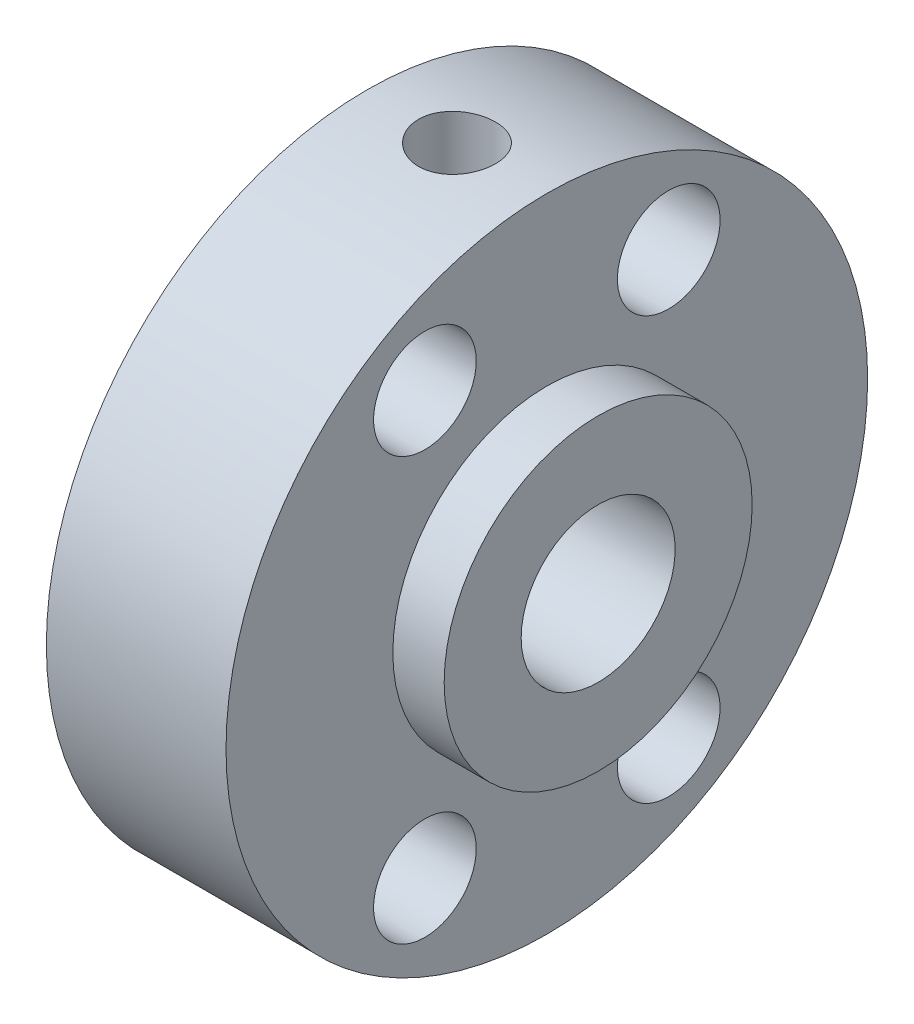
ISO-10303-21;
HEADER;
FILE_DESCRIPTION(('STEP AP214'),'2;1');
FILE_NAME('part.step','',(''),(''),'','','');
FILE_SCHEMA(('AUTOMOTIVE_DESIGN { 1 0 10303 214 1 1 1 1 }'));
ENDSEC;
DATA;
#1=APPLICATION_CONTEXT('core data for automotive mechanical design processes');
#2=APPLICATION_PROTOCOL_DEFINITION('international standard','automotive_design',2000,#1);
#3=PRODUCT_CONTEXT('',#1,'mechanical');
#4=PRODUCT('Part','Part','',(#3));
#5=PRODUCT_RELATED_PRODUCT_CATEGORY('part','',(#4));
#6=PRODUCT_DEFINITION_FORMATION('','',#4);
#7=PRODUCT_DEFINITION_CONTEXT('part definition',#1,'design');
#8=PRODUCT_DEFINITION('design','',#6,#7);
#9=PRODUCT_DEFINITION_SHAPE('','',#8);
#10=(LENGTH_UNIT() NAMED_UNIT(*) SI_UNIT(.MILLI.,.METRE.));
#11=(NAMED_UNIT(*) PLANE_ANGLE_UNIT() SI_UNIT($,.RADIAN.));
#12=(NAMED_UNIT(*) SI_UNIT($,.STERADIAN.) SOLID_ANGLE_UNIT());
#13=UNCERTAINTY_MEASURE_WITH_UNIT(LENGTH_MEASURE(1.E-05),#10,'distance_accuracy_value','');
#14=(GEOMETRIC_REPRESENTATION_CONTEXT(3) GLOBAL_UNCERTAINTY_ASSIGNED_CONTEXT((#13)) GLOBAL_UNIT_ASSIGNED_CONTEXT((#10,
#11,#12)) REPRESENTATION_CONTEXT('',''));
#15=CARTESIAN_POINT('',(0.,0.,0.));
#16=DIRECTION('',(0.,0.,1.));
#17=DIRECTION('',(1.,0.,0.));
#18=AXIS2_PLACEMENT_3D('',#15,#16,#17);
#19=CARTESIAN_POINT('',(0.,0.,0.));
#20=DIRECTION('',(-1.,0.,0.));
#21=DIRECTION('',(0.,0.,1.));
#22=AXIS2_PLACEMENT_3D('',#19,#20,#21);
#23=CYLINDRICAL_SURFACE('',#22,3.);
#24=CARTESIAN_POINT('',(9.,0.,0.));
#25=DIRECTION('',(-1.,0.,0.));
#26=DIRECTION('',(0.,0.,1.));
#27=AXIS2_PLACEMENT_3D('',#24,#25,#26);
#28=CIRCLE('',#27,3.);
#29=CARTESIAN_POINT('',(9.,0.,3.));
#30=VERTEX_POINT('',#29);
#31=EDGE_CURVE('E63',#30,#30,#28,.T.);
#32=ORIENTED_EDGE('',*,*,#31,.F.);
#33=EDGE_LOOP('',(#32));
#34=FACE_BOUND('',#33,.T.);
#35=CARTESIAN_POINT('',(0.,0.,0.));
#36=DIRECTION('',(-1.,0.,0.));
#37=DIRECTION('',(0.,0.,1.));
#38=AXIS2_PLACEMENT_3D('',#35,#36,#37);
#39=CIRCLE('',#38,3.);
#40=CARTESIAN_POINT('',(0.,0.,3.));
#41=VERTEX_POINT('',#40);
#42=EDGE_CURVE('E10',#41,#41,#39,.T.);
#43=ORIENTED_EDGE('',*,*,#42,.T.);
#44=EDGE_LOOP('',(#43));
#45=FACE_BOUND('',#44,.T.);
#46=CARTESIAN_POINT('',(3.5,2.59807621135332,-1.5));
#47=CARTESIAN_POINT('',(3.57816171229288,2.59808302092689,-1.4999945446118));
#48=CARTESIAN_POINT('',(3.65642211728757,2.60165701781635,-1.49384995609982));
#49=CARTESIAN_POINT('',(3.81054089701573,2.61543549678079,-1.46958481484708));
#50=CARTESIAN_POINT('',(3.88639387256511,2.62565391083339,-1.45143909683127));
#51=CARTESIAN_POINT('',(4.03317749651591,2.65124019908098,-1.40414992304972));
#52=CARTESIAN_POINT('',(4.10413197871038,2.66658065209878,-1.3750649287406));
#53=CARTESIAN_POINT('',(4.24013630299508,2.70063997225287,-1.30690128806456));
#54=CARTESIAN_POINT('',(4.30518582539369,2.71935902214097,-1.26782210105366));
#55=CARTESIAN_POINT('',(4.43345859283626,2.75995303586162,-1.17699981079632));
#56=CARTESIAN_POINT('',(4.49608870351032,2.7819609545693,-1.12447805421565));
#57=CARTESIAN_POINT('',(4.61211258261006,2.82557974178559,-1.0098807114217));
#58=CARTESIAN_POINT('',(4.66550174387528,2.84719040746875,-0.947800388673439));
#59=CARTESIAN_POINT('',(4.76505072672149,2.88932215429424,-0.810734345121818));
#60=CARTESIAN_POINT('',(4.81048065178929,2.90967159627259,-0.735160783518861));
#61=CARTESIAN_POINT('',(4.88771127986864,2.94526134149293,-0.576235539899255));
#62=CARTESIAN_POINT('',(4.91952058420575,2.96050486775612,-0.492888807207232));
#63=CARTESIAN_POINT('',(4.96625699195164,2.98320691866356,-0.327067415888966));
#64=CARTESIAN_POINT('',(4.9822242895333,2.99114220331338,-0.244952685733226));
#65=CARTESIAN_POINT('',(5.00024917801256,3.000113757691,-0.0788559430467724));
#66=CARTESIAN_POINT('',(5.00231518519356,3.00115420176885,0.00512490876560744));
#67=CARTESIAN_POINT('',(4.99287998904448,2.99644472874675,0.164748786635625));
#68=CARTESIAN_POINT('',(4.98254297671817,2.99127743838241,0.240481798765187));
#69=CARTESIAN_POINT('',(4.95067873414301,2.97561367889621,0.388970657877483));
#70=CARTESIAN_POINT('',(4.92915066653566,2.96511681099591,0.461726281640888));
#71=CARTESIAN_POINT('',(4.87537615086528,2.93957374931482,0.60346408735433));
#72=CARTESIAN_POINT('',(4.8429855302419,2.92446662293799,0.672380135272767));
#73=CARTESIAN_POINT('',(4.76860487569776,2.89106468980031,0.803965202269992));
#74=CARTESIAN_POINT('',(4.72661140504647,2.87276874236226,0.866631973257968));
#75=CARTESIAN_POINT('',(4.62965697270048,2.83266591598844,0.990260491347292));
#76=CARTESIAN_POINT('',(4.57384545751099,2.81069063997263,1.05050111254404));
#77=CARTESIAN_POINT('',(4.45311541260473,2.76681510880218,1.16115655544667));
#78=CARTESIAN_POINT('',(4.38818994158891,2.74491492398443,1.21156381736135));
#79=CARTESIAN_POINT('',(4.24602771136387,2.70216234138727,1.30425800196332));
#80=CARTESIAN_POINT('',(4.16827096541868,2.68146479986061,1.34582597246708));
#81=CARTESIAN_POINT('',(4.0055934929615,2.64563175417864,1.41497866950185));
#82=CARTESIAN_POINT('',(3.92068035047366,2.63049045069101,1.44257798731633));
#83=CARTESIAN_POINT('',(3.75317823307581,2.60916953725552,1.48077031653756));
#84=CARTESIAN_POINT('',(3.67093832143467,2.60237483772745,1.49253768317996));
#85=CARTESIAN_POINT('',(3.50539798772519,2.59676879042414,1.50227541991714));
#86=CARTESIAN_POINT('',(3.42209835632032,2.59795180333967,1.50025553597254));
#87=CARTESIAN_POINT('',(3.26651912213191,2.60751504810877,1.48355406501595));
#88=CARTESIAN_POINT('',(3.19403082333811,2.61509381259981,1.4702817250687));
#89=CARTESIAN_POINT('',(3.05244832059356,2.63541032327012,1.43354442694866));
#90=CARTESIAN_POINT('',(2.98335522388009,2.64814974007551,1.41007616793542));
#91=CARTESIAN_POINT('',(2.84688300364596,2.67804333119485,1.35247138290733));
#92=CARTESIAN_POINT('',(2.77973147471967,2.69537464864595,1.31789109553908));
#93=CARTESIAN_POINT('',(2.65179609269151,2.73234179245875,1.23943059602371));
#94=CARTESIAN_POINT('',(2.59101553473008,2.75197880032721,1.19554560649832));
#95=CARTESIAN_POINT('',(2.46953184871468,2.79431997684504,1.09325575079828));
#96=CARTESIAN_POINT('',(2.40980427392351,2.81709874731434,1.03371790847245));
#97=CARTESIAN_POINT('',(2.30088164300961,2.86101352466839,0.905106743097433));
#98=CARTESIAN_POINT('',(2.25169014465419,2.88214897511564,0.83603021198302));
#99=CARTESIAN_POINT('',(2.16413941107485,2.92112042536435,0.687803043838135));
#100=CARTESIAN_POINT('',(2.12610032268364,2.93885462508044,0.608434646361169));
#101=CARTESIAN_POINT('',(2.06429314421391,2.96825032438951,0.443283546961623));
#102=CARTESIAN_POINT('',(2.04051252295054,2.97991715514559,0.357506552088264));
#103=CARTESIAN_POINT('',(2.00994715373801,2.99501262272824,0.190469523495626));
#104=CARTESIAN_POINT('',(2.00180318618583,2.99909891862287,0.109517165775686));
#105=CARTESIAN_POINT('',(1.9987351018184,3.00063195562697,-0.0526889789268051));
#106=CARTESIAN_POINT('',(2.00380635721466,2.99808102100335,-0.13394265044263));
#107=CARTESIAN_POINT('',(2.02612461019344,2.98700953256884,-0.28880698847572));
#108=CARTESIAN_POINT('',(2.04254727388651,2.97889342001985,-0.362568476716895));
#109=CARTESIAN_POINT('',(2.08599049895446,2.95788140495135,-0.506168928275426));
#110=CARTESIAN_POINT('',(2.11301258014018,2.94498481699194,-0.576007327433263));
#111=CARTESIAN_POINT('',(2.17809057824896,2.9148889612218,-0.713135109367326));
#112=CARTESIAN_POINT('',(2.21656898481176,2.89752925798199,-0.780187714050069));
#113=CARTESIAN_POINT('',(2.30293689628858,2.86032199712739,-0.907161962721036));
#114=CARTESIAN_POINT('',(2.35083072367351,2.84047329837541,-0.96708031112236));
#115=CARTESIAN_POINT('',(2.46019570853405,2.79792915339941,-1.08437100623534));
#116=CARTESIAN_POINT('',(2.52254373121579,2.77514698517547,-1.14089652680891));
#117=CARTESIAN_POINT('',(2.65617608169466,2.73094614244278,-1.24299493109201));
#118=CARTESIAN_POINT('',(2.72746823130153,2.70952868642798,-1.28855812501509));
#119=CARTESIAN_POINT('',(2.87995496987143,2.66999407957374,-1.36864661967848));
#120=CARTESIAN_POINT('',(2.9613912966931,2.65200261384405,-1.40277759894141));
#121=CARTESIAN_POINT('',(3.12999860650967,2.62299234492527,-1.45631806425962));
#122=CARTESIAN_POINT('',(3.21714933336903,2.61195024221553,-1.47577678676302));
#123=CARTESIAN_POINT('',(3.33770803347799,2.60293908902686,-1.49155051179662));
#124=CARTESIAN_POINT('',(3.37005184159682,2.60112193507728,-1.49471415744578));
#125=CARTESIAN_POINT('',(3.43492472102337,2.59868903831625,-1.49894010763494));
#126=CARTESIAN_POINT('',(3.46745380457881,2.59807337587664,-1.50000227159981));
#127=CARTESIAN_POINT('',(3.5,2.59807621135332,-1.5));
#128=B_SPLINE_CURVE_WITH_KNOTS('',3,(#46,#47,#48,#49,#50,#51,#52,#53,#54,#55,#56,#57,#58,#59,
#60,#61,#62,#63,#64,#65,#66,#67,#68,#69,#70,#71,#72,#73,#74,#75,#76,#77,#78,#79,#80,#81,#82,#83,
#84,#85,#86,#87,#88,#89,#90,#91,#92,#93,#94,#95,#96,#97,#98,#99,#100,#101,#102,#103,#104,#105,
#106,#107,#108,#109,#110,#111,#112,#113,#114,#115,#116,#117,#118,#119,#120,#121,#122,#123,#124,
#125,#126,#127),.UNSPECIFIED.,.T.,.F.,(4,2,2,2,2,2,2,2,2,2,2,2,2,2,2,2,2,2,2,2,2,2,2,2,2,2,2,2,
2,2,2,2,2,2,2,2,2,2,2,2,4),(0.,0.234348183892073,0.469189339237207,0.702792893878327,
0.936409088167724,1.18929346874735,1.44230356626556,1.71236838358145,1.98226240445836,
2.23295227451903,2.4834903552906,2.71224146226807,2.94100968776182,3.1729430209672,
3.40495949025407,3.65890787185336,3.91305072368878,4.18333262594172,4.45333161317557,
4.70193436281317,4.95036139782559,5.17161275136038,5.39293578654094,5.62450944609131,
5.85620229330071,6.11710115370919,6.37808797467303,6.64596272119448,6.91360169713157,
7.1566840558423,7.39968130190957,7.62666637307238,7.85368400268019,8.09041126079207,
8.32724745151078,8.587653627751,8.84828914267731,9.11716123557907,9.38512699504139,
9.48270202777963,9.5802835874181),.UNSPECIFIED.);
#129=CARTESIAN_POINT('',(3.5,2.59807621135332,-1.5));
#130=VERTEX_POINT('',#129);
#131=EDGE_CURVE('E88',#130,#130,#128,.T.);
#132=ORIENTED_EDGE('',*,*,#131,.F.);
#133=EDGE_LOOP('',(#132));
#134=FACE_BOUND('',#133,.T.);
#135=ADVANCED_FACE('F35',(#34,#45,#134),#23,.F.);
#136=CARTESIAN_POINT('',(0.,0.,0.));
#137=DIRECTION('',(-1.,0.,0.));
#138=DIRECTION('',(0.,0.,1.));
#139=AXIS2_PLACEMENT_3D('',#136,#137,#138);
#140=CYLINDRICAL_SURFACE('',#139,12.5);
#141=CARTESIAN_POINT('',(0.,0.,0.));
#142=DIRECTION('',(-1.,0.,0.));
#143=DIRECTION('',(0.,0.,1.));
#144=AXIS2_PLACEMENT_3D('',#141,#142,#143);
#145=CIRCLE('',#144,12.5);
#146=CARTESIAN_POINT('',(0.,0.,12.5));
#147=VERTEX_POINT('',#146);
#148=EDGE_CURVE('E48',#147,#147,#145,.T.);
#149=ORIENTED_EDGE('',*,*,#148,.F.);
#150=EDGE_LOOP('',(#149));
#151=FACE_BOUND('',#150,.T.);
#152=CARTESIAN_POINT('',(7.,0.,0.));
#153=DIRECTION('',(-1.,0.,0.));
#154=DIRECTION('',(0.,0.,1.));
#155=AXIS2_PLACEMENT_3D('',#152,#153,#154);
#156=CIRCLE('',#155,12.5);
#157=CARTESIAN_POINT('',(7.,0.,12.5));
#158=VERTEX_POINT('',#157);
#159=EDGE_CURVE('E52',#158,#158,#156,.T.);
#160=ORIENTED_EDGE('',*,*,#159,.T.);
#161=EDGE_LOOP('',(#160));
#162=FACE_BOUND('',#161,.T.);
#163=CARTESIAN_POINT('',(3.5,12.4096736459909,-1.5));
#164=CARTESIAN_POINT('',(3.41607042940482,12.4096748089167,-1.49999641586388));
#165=CARTESIAN_POINT('',(3.3320877399393,12.4105342894214,-1.49293206748169));
#166=CARTESIAN_POINT('',(3.16645769398422,12.4138782255216,-1.46486159354819));
#167=CARTESIAN_POINT('',(3.08481290215949,12.4163643992983,-1.44384072619508));
#168=CARTESIAN_POINT('',(2.92628079724309,12.4226761552619,-1.38848417307918));
#169=CARTESIAN_POINT('',(2.84939036943189,12.426500849368,-1.35415731394874));
#170=CARTESIAN_POINT('',(2.70247642894952,12.4350576249844,-1.27318168778971));
#171=CARTESIAN_POINT('',(2.63245170421602,12.4397895458966,-1.22653510106007));
#172=CARTESIAN_POINT('',(2.50088011419491,12.4496550027324,-1.12198571965019));
#173=CARTESIAN_POINT('',(2.4393738528257,12.4547902908254,-1.06403198625323));
#174=CARTESIAN_POINT('',(2.32693564091905,12.4648680792729,-0.938622932174393));
#175=CARTESIAN_POINT('',(2.2760042070291,12.4698105701984,-0.871167147527067));
#176=CARTESIAN_POINT('',(2.18601673353186,12.4789637011531,-0.728414784233987));
#177=CARTESIAN_POINT('',(2.14699729213018,12.4831720690333,-0.653094976924494));
#178=CARTESIAN_POINT('',(2.08217576980763,12.4903635621621,-0.496912883636388));
#179=CARTESIAN_POINT('',(2.05637323512614,12.4933467294733,-0.41605078804277));
#180=CARTESIAN_POINT('',(2.01883887194828,12.4977393662263,-0.25149392849254));
#181=CARTESIAN_POINT('',(2.00703967327712,12.4991563682204,-0.167814735521689));
#182=CARTESIAN_POINT('',(1.99763820034474,12.5002827183051,0.000347248334282976));
#183=CARTESIAN_POINT('',(2.00003540892089,12.4999921286017,0.0848300098341701));
#184=CARTESIAN_POINT('',(2.01890456092568,12.4977421462633,0.251742833758765));
#185=CARTESIAN_POINT('',(2.0353040524862,12.4957913442169,0.334181218784106));
#186=CARTESIAN_POINT('',(2.081599075858,12.490449821119,0.495127185045588));
#187=CARTESIAN_POINT('',(2.11149484709083,12.4870590745233,0.573634696521302));
#188=CARTESIAN_POINT('',(2.18401136445326,12.4792038952277,0.724715561629688));
#189=CARTESIAN_POINT('',(2.22666361800321,12.4747368094346,0.797273648637692));
#190=CARTESIAN_POINT('',(2.32345944947808,12.465229048358,0.934229460099392));
#191=CARTESIAN_POINT('',(2.37760351320781,12.4601883488298,0.998626839383445));
#192=CARTESIAN_POINT('',(2.49625217477023,12.4500603372648,1.11785860561525));
#193=CARTESIAN_POINT('',(2.56081989068675,12.4449729316271,1.17263019439189));
#194=CARTESIAN_POINT('',(2.69826575683975,12.4353563023037,1.27056795912578));
#195=CARTESIAN_POINT('',(2.77114392958224,12.4308270801297,1.31373410365263));
#196=CARTESIAN_POINT('',(2.92319624507369,12.4228396027608,1.38723839179325));
#197=CARTESIAN_POINT('',(3.00237272062895,12.4193817467283,1.41757175578821));
#198=CARTESIAN_POINT('',(3.16474617975059,12.4139364153306,1.46449505016189));
#199=CARTESIAN_POINT('',(3.24794298505965,12.4119488748366,1.48108558929275));
#200=CARTESIAN_POINT('',(3.41544154818834,12.4096810007818,1.49996964356083));
#201=CARTESIAN_POINT('',(3.49973321794057,12.4093901280317,1.50235142135386));
#202=CARTESIAN_POINT('',(3.66751439042147,12.4105206650573,1.49298299027801));
#203=CARTESIAN_POINT('',(3.75100390884369,12.411942041265,1.48123305845624));
#204=CARTESIAN_POINT('',(3.91454789179899,12.4163273137489,1.44400895971009));
#205=CARTESIAN_POINT('',(3.99461217340466,12.4192864301079,1.41857731249469));
#206=CARTESIAN_POINT('',(4.14933964148798,12.4264098926624,1.35475538396312));
#207=CARTESIAN_POINT('',(4.22400265225152,12.4305742780457,1.31636468129306));
#208=CARTESIAN_POINT('',(4.36620814748731,12.4396643656649,1.22749651360805));
#209=CARTESIAN_POINT('',(4.43371414344065,12.4445936804928,1.17696103570738));
#210=CARTESIAN_POINT('',(4.5593175565059,12.4546467770184,1.06532008918353));
#211=CARTESIAN_POINT('',(4.61741463670294,12.4597705656719,1.0042142422181));
#212=CARTESIAN_POINT('',(4.72285987361746,12.4696675472455,0.87278213633386));
#213=CARTESIAN_POINT('',(4.77015012325571,12.4744387628015,0.802409249708916));
#214=CARTESIAN_POINT('',(4.85223910466455,12.483063621558,0.654668214705289));
#215=CARTESIAN_POINT('',(4.88703807118722,12.4869172820019,0.577300197822207));
#216=CARTESIAN_POINT('',(4.9430605024379,12.4932640215257,0.417959622359992));
#217=CARTESIAN_POINT('',(4.96431775994212,12.4957604851314,0.33599908532359));
#218=CARTESIAN_POINT('',(4.99276337179108,12.4991255682254,0.169640292495738));
#219=CARTESIAN_POINT('',(4.99995230834657,12.4999942550783,0.0852421377306299));
#220=CARTESIAN_POINT('',(5.00004692205616,12.5000056524324,-0.0830300031278303));
#221=CARTESIAN_POINT('',(4.99304201834161,12.4991591682624,-0.166903952329437));
#222=CARTESIAN_POINT('',(4.96513677254876,12.4958567701035,-0.332273612398118));
#223=CARTESIAN_POINT('',(4.94423643502524,12.4934008566421,-0.413769324044744));
#224=CARTESIAN_POINT('',(4.88916099243421,12.4871544009745,-0.572059777991808));
#225=CARTESIAN_POINT('',(4.85498981777275,12.4833642539575,-0.648855904373999));
#226=CARTESIAN_POINT('',(4.7743519652078,12.474869622158,-0.795637705262655));
#227=CARTESIAN_POINT('',(4.72788518779857,12.4701651299761,-0.865623324646851));
#228=CARTESIAN_POINT('',(4.62364315899687,12.4603319681132,-0.997254742124291));
#229=CARTESIAN_POINT('',(4.56580132233712,12.4552009088046,-1.0588476339384));
#230=CARTESIAN_POINT('',(4.44058848142378,12.4451123432295,-1.17148865356204));
#231=CARTESIAN_POINT('',(4.37321521774934,12.4401548784622,-1.22253427406543));
#232=CARTESIAN_POINT('',(4.23057853191475,12.4309559603764,-1.31278537364373));
#233=CARTESIAN_POINT('',(4.15528783586352,12.4267171228205,-1.35194799100155));
#234=CARTESIAN_POINT('',(3.99919112312461,12.419466118837,-1.41701902911872));
#235=CARTESIAN_POINT('',(3.91839126440112,12.4164526081981,-1.44294198213015));
#236=CARTESIAN_POINT('',(3.7809702304473,12.4127313618494,-1.4745350503682));
#237=CARTESIAN_POINT('',(3.72521862402006,12.4115903654975,-1.48407082470974));
#238=CARTESIAN_POINT('',(3.61298603393287,12.4100611186528,-1.49680448454755));
#239=CARTESIAN_POINT('',(3.5565050552187,12.4096728630583,-1.50000241299709));
#240=CARTESIAN_POINT('',(3.5,12.4096736459909,-1.5));
#241=B_SPLINE_CURVE_WITH_KNOTS('',3,(#163,#164,#165,#166,#167,#168,#169,#170,#171,#172,#173,
#174,#175,#176,#177,#178,#179,#180,#181,#182,#183,#184,#185,#186,#187,#188,#189,#190,#191,#192,
#193,#194,#195,#196,#197,#198,#199,#200,#201,#202,#203,#204,#205,#206,#207,#208,#209,#210,#211,
#212,#213,#214,#215,#216,#217,#218,#219,#220,#221,#222,#223,#224,#225,#226,#227,#228,#229,#230,
#231,#232,#233,#234,#235,#236,#237,#238,#239,#240),.UNSPECIFIED.,.T.,.F.,(4,2,2,2,2,2,2,2,2,2,2,
2,2,2,2,2,2,2,2,2,2,2,2,2,2,2,2,2,2,2,2,2,2,2,2,2,2,2,4),(0.,0.25158230660961,0.503430774819312,
0.755112462522262,1.0067496383611,1.25954776660377,1.51235824273611,1.76593780876769,
2.01950866836447,2.27185458608052,2.52419131111312,2.77523023079344,3.02627360403335,
3.27794222677635,3.52962149067918,3.78288622204422,4.03615163930559,4.28951130338294,
4.54285974404081,4.79463277043148,5.0464008609825,5.29739099483104,5.54838929022027,
5.80061125155308,6.05284224246467,6.30639464647639,6.55994228515918,6.81285470170487,
7.06575665136928,7.31707030939075,7.56838388503437,7.81962308616497,8.07086432058376,
8.32362252061905,8.57644073759112,8.83016031080822,9.08360079205962,9.25297814464871,
9.42235434931908),.UNSPECIFIED.);
#242=CARTESIAN_POINT('',(3.5,12.4096736459909,-1.5));
#243=VERTEX_POINT('',#242);
#244=EDGE_CURVE('E39',#243,#243,#241,.T.);
#245=ORIENTED_EDGE('',*,*,#244,.F.);
#246=EDGE_LOOP('',(#245));
#247=FACE_BOUND('',#246,.T.);
#248=ADVANCED_FACE('F129',(#151,#162,#247),#140,.T.);
#249=CARTESIAN_POINT('',(0.,3.,0.));
#250=DIRECTION('',(1.,0.,0.));
#251=DIRECTION('',(0.,0.,-1.));
#252=AXIS2_PLACEMENT_3D('',#249,#250,#251);
#253=PLANE('',#252);
#254=CARTESIAN_POINT('',(0.,8.22724133595217,-4.75000000000001));
#255=DIRECTION('',(1.,0.,0.));
#256=DIRECTION('',(0.,0.,-1.));
#257=AXIS2_PLACEMENT_3D('',#254,#255,#256);
#258=CIRCLE('',#257,2.);
#259=CARTESIAN_POINT('',(0.,8.22724133595217,-6.75000000000001));
#260=VERTEX_POINT('',#259);
#261=EDGE_CURVE('E70',#260,#260,#258,.T.);
#262=ORIENTED_EDGE('',*,*,#261,.T.);
#263=EDGE_LOOP('',(#262));
#264=FACE_BOUND('',#263,.T.);
#265=CARTESIAN_POINT('',(0.,-8.22724133595218,4.75000000000002));
#266=DIRECTION('',(1.,0.,0.));
#267=DIRECTION('',(0.,0.,-1.));
#268=AXIS2_PLACEMENT_3D('',#265,#266,#267);
#269=CIRCLE('',#268,2.);
#270=CARTESIAN_POINT('',(0.,-8.22724133595218,2.75000000000002));
#271=VERTEX_POINT('',#270);
#272=EDGE_CURVE('E76',#271,#271,#269,.T.);
#273=ORIENTED_EDGE('',*,*,#272,.T.);
#274=EDGE_LOOP('',(#273));
#275=FACE_BOUND('',#274,.T.);
#276=CARTESIAN_POINT('',(0.,-8.22724133595216,-4.75000000000002));
#277=DIRECTION('',(1.,0.,0.));
#278=DIRECTION('',(0.,0.,-1.));
#279=AXIS2_PLACEMENT_3D('',#276,#277,#278);
#280=CIRCLE('',#279,2.);
#281=CARTESIAN_POINT('',(0.,-8.22724133595216,-6.75000000000002));
#282=VERTEX_POINT('',#281);
#283=EDGE_CURVE('E77',#282,#282,#280,.T.);
#284=ORIENTED_EDGE('',*,*,#283,.T.);
#285=EDGE_LOOP('',(#284));
#286=FACE_BOUND('',#285,.T.);
#287=CARTESIAN_POINT('',(0.,8.22724133595216,4.75000000000001));
#288=DIRECTION('',(1.,0.,0.));
#289=DIRECTION('',(0.,0.,-1.));
#290=AXIS2_PLACEMENT_3D('',#287,#288,#289);
#291=CIRCLE('',#290,2.);
#292=CARTESIAN_POINT('',(0.,8.22724133595216,2.75000000000001));
#293=VERTEX_POINT('',#292);
#294=EDGE_CURVE('E66',#293,#293,#291,.T.);
#295=ORIENTED_EDGE('',*,*,#294,.T.);
#296=EDGE_LOOP('',(#295));
#297=FACE_BOUND('',#296,.T.);
#298=ORIENTED_EDGE('',*,*,#42,.F.);
#299=EDGE_LOOP('',(#298));
#300=FACE_BOUND('',#299,.T.);
#301=ORIENTED_EDGE('',*,*,#148,.T.);
#302=EDGE_LOOP('',(#301));
#303=FACE_BOUND('',#302,.T.);
#304=ADVANCED_FACE('F127',(#264,#275,#286,#297,#300,#303),#253,.F.);
#305=CARTESIAN_POINT('',(7.,12.5,0.));
#306=DIRECTION('',(-1.,0.,0.));
#307=DIRECTION('',(0.,0.,1.));
#308=AXIS2_PLACEMENT_3D('',#305,#306,#307);
#309=PLANE('',#308);
#310=CARTESIAN_POINT('',(7.,8.22724133595217,-4.75000000000001));
#311=DIRECTION('',(1.,0.,0.));
#312=DIRECTION('',(0.,0.,-1.));
#313=AXIS2_PLACEMENT_3D('',#310,#311,#312);
#314=CIRCLE('',#313,2.);
#315=CARTESIAN_POINT('',(7.,8.22724133595217,-6.75000000000001));
#316=VERTEX_POINT('',#315);
#317=EDGE_CURVE('E80',#316,#316,#314,.T.);
#318=ORIENTED_EDGE('',*,*,#317,.F.);
#319=EDGE_LOOP('',(#318));
#320=FACE_BOUND('',#319,.T.);
#321=CARTESIAN_POINT('',(7.,-8.22724133595218,4.75000000000002));
#322=DIRECTION('',(1.,0.,0.));
#323=DIRECTION('',(0.,0.,-1.));
#324=AXIS2_PLACEMENT_3D('',#321,#322,#323);
#325=CIRCLE('',#324,2.);
#326=CARTESIAN_POINT('',(7.,-8.22724133595218,2.75000000000002));
#327=VERTEX_POINT('',#326);
#328=EDGE_CURVE('E73',#327,#327,#325,.T.);
#329=ORIENTED_EDGE('',*,*,#328,.F.);
#330=EDGE_LOOP('',(#329));
#331=FACE_BOUND('',#330,.T.);
#332=CARTESIAN_POINT('',(7.,-8.22724133595216,-4.75000000000002));
#333=DIRECTION('',(1.,0.,0.));
#334=DIRECTION('',(0.,0.,-1.));
#335=AXIS2_PLACEMENT_3D('',#332,#333,#334);
#336=CIRCLE('',#335,2.);
#337=CARTESIAN_POINT('',(7.,-8.22724133595216,-6.75000000000002));
#338=VERTEX_POINT('',#337);
#339=EDGE_CURVE('E85',#338,#338,#336,.T.);
#340=ORIENTED_EDGE('',*,*,#339,.F.);
#341=EDGE_LOOP('',(#340));
#342=FACE_BOUND('',#341,.T.);
#343=CARTESIAN_POINT('',(7.,8.22724133595216,4.75000000000001));
#344=DIRECTION('',(1.,0.,0.));
#345=DIRECTION('',(0.,0.,-1.));
#346=AXIS2_PLACEMENT_3D('',#343,#344,#345);
#347=CIRCLE('',#346,2.);
#348=CARTESIAN_POINT('',(7.,8.22724133595216,2.75000000000001));
#349=VERTEX_POINT('',#348);
#350=EDGE_CURVE('E67',#349,#349,#347,.T.);
#351=ORIENTED_EDGE('',*,*,#350,.F.);
#352=EDGE_LOOP('',(#351));
#353=FACE_BOUND('',#352,.T.);
#354=ORIENTED_EDGE('',*,*,#159,.F.);
#355=EDGE_LOOP('',(#354));
#356=FACE_BOUND('',#355,.T.);
#357=CARTESIAN_POINT('',(7.,0.,0.));
#358=DIRECTION('',(-1.,0.,0.));
#359=DIRECTION('',(0.,0.,1.));
#360=AXIS2_PLACEMENT_3D('',#357,#358,#359);
#361=CIRCLE('',#360,6.);
#362=CARTESIAN_POINT('',(7.,0.,6.));
#363=VERTEX_POINT('',#362);
#364=EDGE_CURVE('E57',#363,#363,#361,.T.);
#365=ORIENTED_EDGE('',*,*,#364,.T.);
#366=EDGE_LOOP('',(#365));
#367=FACE_BOUND('',#366,.T.);
#368=ADVANCED_FACE('F124',(#320,#331,#342,#353,#356,#367),#309,.F.);
#369=CARTESIAN_POINT('',(0.,0.,0.));
#370=DIRECTION('',(-1.,0.,0.));
#371=DIRECTION('',(0.,0.,1.));
#372=AXIS2_PLACEMENT_3D('',#369,#370,#371);
#373=CYLINDRICAL_SURFACE('',#372,6.);
#374=ORIENTED_EDGE('',*,*,#364,.F.);
#375=EDGE_LOOP('',(#374));
#376=FACE_BOUND('',#375,.T.);
#377=CARTESIAN_POINT('',(9.,0.,0.));
#378=DIRECTION('',(-1.,0.,0.));
#379=DIRECTION('',(0.,0.,1.));
#380=AXIS2_PLACEMENT_3D('',#377,#378,#379);
#381=CIRCLE('',#380,6.);
#382=CARTESIAN_POINT('',(9.,0.,6.));
#383=VERTEX_POINT('',#382);
#384=EDGE_CURVE('E60',#383,#383,#381,.T.);
#385=ORIENTED_EDGE('',*,*,#384,.T.);
#386=EDGE_LOOP('',(#385));
#387=FACE_BOUND('',#386,.T.);
#388=ADVANCED_FACE('F120',(#376,#387),#373,.T.);
#389=CARTESIAN_POINT('',(9.,6.,0.));
#390=DIRECTION('',(-1.,0.,0.));
#391=DIRECTION('',(0.,0.,1.));
#392=AXIS2_PLACEMENT_3D('',#389,#390,#391);
#393=PLANE('',#392);
#394=ORIENTED_EDGE('',*,*,#384,.F.);
#395=EDGE_LOOP('',(#394));
#396=FACE_BOUND('',#395,.T.);
#397=ORIENTED_EDGE('',*,*,#31,.T.);
#398=EDGE_LOOP('',(#397));
#399=FACE_BOUND('',#398,.T.);
#400=ADVANCED_FACE('F116',(#396,#399),#393,.F.);
#401=CARTESIAN_POINT('',(0.,8.22724133595216,4.75000000000001));
#402=DIRECTION('',(1.,0.,0.));
#403=DIRECTION('',(0.,0.,-1.));
#404=AXIS2_PLACEMENT_3D('',#401,#402,#403);
#405=CYLINDRICAL_SURFACE('',#404,2.);
#406=ORIENTED_EDGE('',*,*,#294,.F.);
#407=EDGE_LOOP('',(#406));
#408=FACE_BOUND('',#407,.T.);
#409=ORIENTED_EDGE('',*,*,#350,.T.);
#410=EDGE_LOOP('',(#409));
#411=FACE_BOUND('',#410,.T.);
#412=ADVANCED_FACE('F106',(#408,#411),#405,.F.);
#413=CARTESIAN_POINT('',(0.,-8.22724133595216,-4.75000000000002));
#414=DIRECTION('',(1.,0.,0.));
#415=DIRECTION('',(0.,0.,-1.));
#416=AXIS2_PLACEMENT_3D('',#413,#414,#415);
#417=CYLINDRICAL_SURFACE('',#416,2.);
#418=ORIENTED_EDGE('',*,*,#283,.F.);
#419=EDGE_LOOP('',(#418));
#420=FACE_BOUND('',#419,.T.);
#421=ORIENTED_EDGE('',*,*,#339,.T.);
#422=EDGE_LOOP('',(#421));
#423=FACE_BOUND('',#422,.T.);
#424=ADVANCED_FACE('F101',(#420,#423),#417,.F.);
#425=CARTESIAN_POINT('',(0.,-8.22724133595218,4.75000000000002));
#426=DIRECTION('',(1.,0.,0.));
#427=DIRECTION('',(0.,0.,-1.));
#428=AXIS2_PLACEMENT_3D('',#425,#426,#427);
#429=CYLINDRICAL_SURFACE('',#428,2.);
#430=ORIENTED_EDGE('',*,*,#272,.F.);
#431=EDGE_LOOP('',(#430));
#432=FACE_BOUND('',#431,.T.);
#433=ORIENTED_EDGE('',*,*,#328,.T.);
#434=EDGE_LOOP('',(#433));
#435=FACE_BOUND('',#434,.T.);
#436=ADVANCED_FACE('F105',(#432,#435),#429,.F.);
#437=CARTESIAN_POINT('',(0.,8.22724133595217,-4.75000000000001));
#438=DIRECTION('',(1.,0.,0.));
#439=DIRECTION('',(0.,0.,-1.));
#440=AXIS2_PLACEMENT_3D('',#437,#438,#439);
#441=CYLINDRICAL_SURFACE('',#440,2.);
#442=ORIENTED_EDGE('',*,*,#261,.F.);
#443=EDGE_LOOP('',(#442));
#444=FACE_BOUND('',#443,.T.);
#445=ORIENTED_EDGE('',*,*,#317,.T.);
#446=EDGE_LOOP('',(#445));
#447=FACE_BOUND('',#446,.T.);
#448=ADVANCED_FACE('F99',(#444,#447),#441,.F.);
#449=CARTESIAN_POINT('',(3.5,30.,0.));
#450=DIRECTION('',(0.,-1.,0.));
#451=DIRECTION('',(0.,0.,-1.));
#452=AXIS2_PLACEMENT_3D('',#449,#450,#451);
#453=CYLINDRICAL_SURFACE('',#452,1.5);
#454=ORIENTED_EDGE('',*,*,#244,.T.);
#455=EDGE_LOOP('',(#454));
#456=FACE_BOUND('',#455,.T.);
#457=ORIENTED_EDGE('',*,*,#131,.T.);
#458=EDGE_LOOP('',(#457));
#459=FACE_BOUND('',#458,.T.);
#460=ADVANCED_FACE('F95',(#456,#459),#453,.F.);
#461=CLOSED_SHELL('',(#135,#248,#304,#368,#388,#400,#412,#424,#436,#448,#460));
#462=MANIFOLD_SOLID_BREP('B2',#461);
#463=ADVANCED_BREP_SHAPE_REPRESENTATION('',(#18,#462),#14);
#464=SHAPE_DEFINITION_REPRESENTATION(#9,#463);
ENDSEC;
END-ISO-10303-21;
